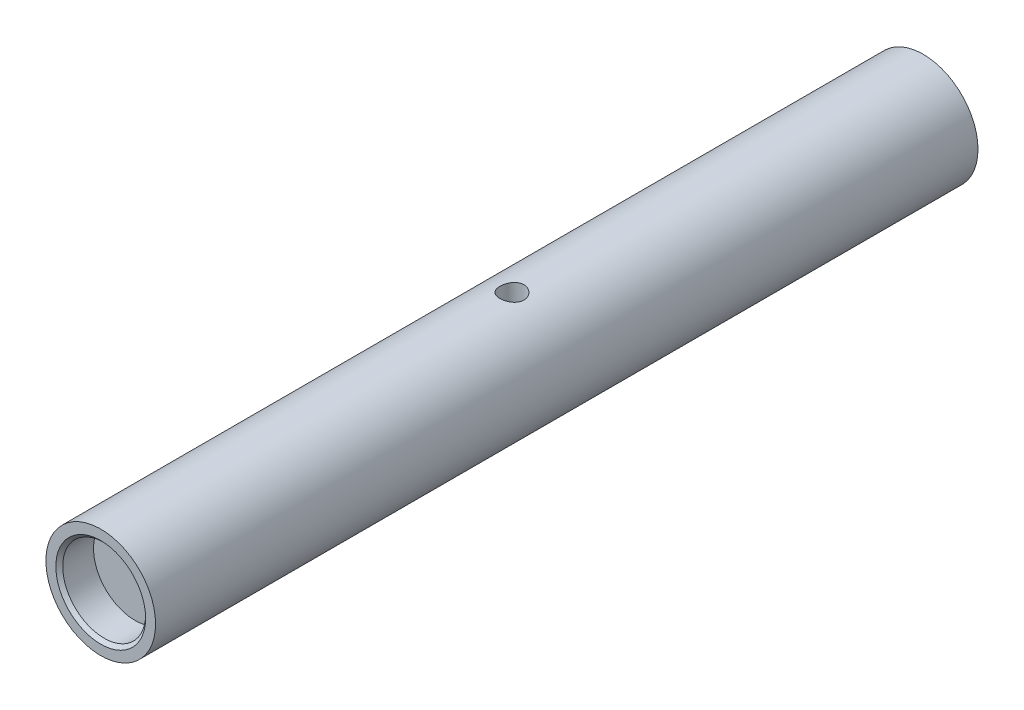
ISO-10303-21;
HEADER;
FILE_DESCRIPTION(('STEP AP214'),'2;1');
FILE_NAME('part.step','',(''),(''),'','','');
FILE_SCHEMA(('AUTOMOTIVE_DESIGN { 1 0 10303 214 1 1 1 1 }'));
ENDSEC;
DATA;
#1=APPLICATION_CONTEXT('core data for automotive mechanical design processes');
#2=APPLICATION_PROTOCOL_DEFINITION('international standard','automotive_design',2000,#1);
#3=PRODUCT_CONTEXT('',#1,'mechanical');
#4=PRODUCT('Part','Part','',(#3));
#5=PRODUCT_RELATED_PRODUCT_CATEGORY('part','',(#4));
#6=PRODUCT_DEFINITION_FORMATION('','',#4);
#7=PRODUCT_DEFINITION_CONTEXT('part definition',#1,'design');
#8=PRODUCT_DEFINITION('design','',#6,#7);
#9=PRODUCT_DEFINITION_SHAPE('','',#8);
#10=(LENGTH_UNIT() NAMED_UNIT(*) SI_UNIT(.MILLI.,.METRE.));
#11=(NAMED_UNIT(*) PLANE_ANGLE_UNIT() SI_UNIT($,.RADIAN.));
#12=(NAMED_UNIT(*) SI_UNIT($,.STERADIAN.) SOLID_ANGLE_UNIT());
#13=UNCERTAINTY_MEASURE_WITH_UNIT(LENGTH_MEASURE(1.E-05),#10,'distance_accuracy_value','');
#14=(GEOMETRIC_REPRESENTATION_CONTEXT(3) GLOBAL_UNCERTAINTY_ASSIGNED_CONTEXT((#13)) GLOBAL_UNIT_ASSIGNED_CONTEXT((#10,
#11,#12)) REPRESENTATION_CONTEXT('',''));
#15=CARTESIAN_POINT('',(0.,0.,0.));
#16=DIRECTION('',(0.,0.,1.));
#17=DIRECTION('',(1.,0.,0.));
#18=AXIS2_PLACEMENT_3D('',#15,#16,#17);
#19=CARTESIAN_POINT('',(0.,0.,0.));
#20=DIRECTION('',(0.,0.,1.));
#21=DIRECTION('',(1.,0.,0.));
#22=AXIS2_PLACEMENT_3D('',#19,#20,#21);
#23=PLANE('',#22);
#24=CARTESIAN_POINT('',(0.,0.,0.));
#25=DIRECTION('',(0.,0.,1.));
#26=DIRECTION('',(1.,0.,0.));
#27=AXIS2_PLACEMENT_3D('',#24,#25,#26);
#28=CIRCLE('',#27,3.275);
#29=CARTESIAN_POINT('',(3.275,0.,0.));
#30=VERTEX_POINT('',#29);
#31=EDGE_CURVE('E126',#30,#30,#28,.T.);
#32=ORIENTED_EDGE('',*,*,#31,.T.);
#33=EDGE_LOOP('',(#32));
#34=FACE_BOUND('',#33,.T.);
#35=CARTESIAN_POINT('',(0.,0.,0.));
#36=DIRECTION('',(0.,0.,1.));
#37=DIRECTION('',(1.,0.,0.));
#38=AXIS2_PLACEMENT_3D('',#35,#36,#37);
#39=CIRCLE('',#38,4.);
#40=CARTESIAN_POINT('',(4.,0.,0.));
#41=VERTEX_POINT('',#40);
#42=EDGE_CURVE('E129',#41,#41,#39,.T.);
#43=ORIENTED_EDGE('',*,*,#42,.F.);
#44=EDGE_LOOP('',(#43));
#45=FACE_BOUND('',#44,.T.);
#46=ADVANCED_FACE('F58',(#34,#45),#23,.F.);
#47=CARTESIAN_POINT('',(0.,0.,60.));
#48=DIRECTION('',(0.,0.,-1.));
#49=DIRECTION('',(-1.,0.,0.));
#50=AXIS2_PLACEMENT_3D('',#47,#48,#49);
#51=CYLINDRICAL_SURFACE('',#50,4.);
#52=CARTESIAN_POINT('',(0.,-4.,30.875));
#53=CARTESIAN_POINT('',(0.0485296675075799,-3.999999104881,30.8749983428683));
#54=CARTESIAN_POINT('',(0.0970793594678819,-3.99910785249099,30.8709490066694));
#55=CARTESIAN_POINT('',(0.192799696712597,-3.99563855625355,30.8548754736168));
#56=CARTESIAN_POINT('',(0.239969331544124,-3.99305930725422,30.8428455789276));
#57=CARTESIAN_POINT('',(0.331532361404727,-3.9865011953795,30.8112057558575));
#58=CARTESIAN_POINT('',(0.375928600591133,-3.98252379502992,30.79160374612));
#59=CARTESIAN_POINT('',(0.460800529275785,-3.97359865018097,30.7454012516593));
#60=CARTESIAN_POINT('',(0.501276320062931,-3.96865093076081,30.7188009478104));
#61=CARTESIAN_POINT('',(0.577809589511013,-3.95823836852585,30.6589051446875));
#62=CARTESIAN_POINT('',(0.613795138857461,-3.95276711096147,30.6255188432995));
#63=CARTESIAN_POINT('',(0.679702737263149,-3.94196931566843,30.5531936935482));
#64=CARTESIAN_POINT('',(0.709624245588626,-3.93664279088231,30.5142543505442));
#65=CARTESIAN_POINT('',(0.762871774375957,-3.92667429652769,30.4313966172081));
#66=CARTESIAN_POINT('',(0.786121217885695,-3.92204054646568,30.3874279384103));
#67=CARTESIAN_POINT('',(0.824873444918545,-3.91407431994669,30.2960895789943));
#68=CARTESIAN_POINT('',(0.840377154907059,-3.91074168787371,30.248720305896));
#69=CARTESIAN_POINT('',(0.862960098833079,-3.9058203563413,30.1527056524806));
#70=CARTESIAN_POINT('',(0.87016668480818,-3.90420532386006,30.1040916043573));
#71=CARTESIAN_POINT('',(0.876346796298366,-3.90282296286985,30.0063197196052));
#72=CARTESIAN_POINT('',(0.875321334008504,-3.90305540719905,29.9571619505735));
#73=CARTESIAN_POINT('',(0.865168943291378,-3.90531789681697,29.8606448324483));
#74=CARTESIAN_POINT('',(0.856189962165253,-3.90731511305879,29.8132690349711));
#75=CARTESIAN_POINT('',(0.830619808880288,-3.91283020532071,29.7207129435417));
#76=CARTESIAN_POINT('',(0.814028209565158,-3.91634816667162,29.675532772947));
#77=CARTESIAN_POINT('',(0.773567951295842,-3.92454071287622,29.5882345328551));
#78=CARTESIAN_POINT('',(0.749642406312967,-3.92922428341758,29.5461437067894));
#79=CARTESIAN_POINT('',(0.695233414544362,-3.93921481609642,29.4665195408901));
#80=CARTESIAN_POINT('',(0.664749073651175,-3.94452186318257,29.428986823519));
#81=CARTESIAN_POINT('',(0.59730468744541,-3.95530223130413,29.3586925198039));
#82=CARTESIAN_POINT('',(0.560218839255175,-3.96077666595924,29.3260516876332));
#83=CARTESIAN_POINT('',(0.48103761810218,-3.9711704462268,29.2674331187011));
#84=CARTESIAN_POINT('',(0.43894215437921,-3.97608978177926,29.2414555026855));
#85=CARTESIAN_POINT('',(0.35078922440041,-3.9848350607036,29.1968709211838));
#86=CARTESIAN_POINT('',(0.304723505551048,-3.98865865150265,29.1782797819633));
#87=CARTESIAN_POINT('',(0.210019715620069,-3.9947641368429,29.1491355665162));
#88=CARTESIAN_POINT('',(0.161382019783212,-3.99704625561537,29.1385813211691));
#89=CARTESIAN_POINT('',(0.0639507148145898,-3.99977974679768,29.1259861330918));
#90=CARTESIAN_POINT('',(0.0151793961812069,-4.00026658638469,29.1237802386593));
#91=CARTESIAN_POINT('',(-0.082034870466852,-3.99945405533806,29.1274972717505));
#92=CARTESIAN_POINT('',(-0.130477840534428,-3.99815480588256,29.1334196478074));
#93=CARTESIAN_POINT('',(-0.225113737082573,-3.99393846563228,29.1530883324419));
#94=CARTESIAN_POINT('',(-0.271325513716627,-3.99103927453648,29.1667481209045));
#95=CARTESIAN_POINT('',(-0.360801880163476,-3.98394755671356,29.2014078430434));
#96=CARTESIAN_POINT('',(-0.404066218480078,-3.97975491978885,29.2224084021511));
#97=CARTESIAN_POINT('',(-0.48710164185679,-3.97045389831677,29.2714972068292));
#98=CARTESIAN_POINT('',(-0.526814043017134,-3.96533329557813,29.2996823517689));
#99=CARTESIAN_POINT('',(-0.601004660955358,-3.9547692903853,29.3622126556686));
#100=CARTESIAN_POINT('',(-0.635482196713101,-3.9493258460595,29.3965586148427));
#101=CARTESIAN_POINT('',(-0.698876552531175,-3.93860716335125,29.4711925116543));
#102=CARTESIAN_POINT('',(-0.72767915190767,-3.93333687534893,29.5115783115546));
#103=CARTESIAN_POINT('',(-0.778093630573717,-3.92367580945748,29.596710789346));
#104=CARTESIAN_POINT('',(-0.799705820995297,-3.9192849935165,29.64145727844));
#105=CARTESIAN_POINT('',(-0.834980047203339,-3.91192194395948,29.7338010176641));
#106=CARTESIAN_POINT('',(-0.848686781972237,-3.90894175193223,29.7813805274312));
#107=CARTESIAN_POINT('',(-0.867891936661354,-3.90472304192499,29.8782410023201));
#108=CARTESIAN_POINT('',(-0.873391669486653,-3.90348424536925,29.9275216940066));
#109=CARTESIAN_POINT('',(-0.875970818550232,-3.90290614373566,30.0252339623401));
#110=CARTESIAN_POINT('',(-0.873231339561962,-3.90352598337475,30.0736606048087));
#111=CARTESIAN_POINT('',(-0.859814710209802,-3.9065029151626,30.1693443115484));
#112=CARTESIAN_POINT('',(-0.84913765342234,-3.90885998683107,30.2166013896009));
#113=CARTESIAN_POINT('',(-0.820236455341648,-3.9150258828629,30.3084606158192));
#114=CARTESIAN_POINT('',(-0.802038675909168,-3.91882963261068,30.3530714212863));
#115=CARTESIAN_POINT('',(-0.758635244842823,-3.92746228874877,30.4386336457775));
#116=CARTESIAN_POINT('',(-0.733428862929913,-3.93229130195659,30.4795846828748));
#117=CARTESIAN_POINT('',(-0.676123075430405,-3.94255241571366,30.5575576742069));
#118=CARTESIAN_POINT('',(-0.643894606521509,-3.9479947357973,30.5944834472532));
#119=CARTESIAN_POINT('',(-0.573721027564935,-3.95880058003569,30.6624621234631));
#120=CARTESIAN_POINT('',(-0.535774597741608,-3.96416408568461,30.6935136670407));
#121=CARTESIAN_POINT('',(-0.454648895620082,-3.9742905205065,30.7492481674261));
#122=CARTESIAN_POINT('',(-0.411408110818716,-3.97904475343567,30.7738432563747));
#123=CARTESIAN_POINT('',(-0.321311391687112,-3.98732971331219,30.8153773501883));
#124=CARTESIAN_POINT('',(-0.274458527502611,-3.99086146560895,30.8323227748171));
#125=CARTESIAN_POINT('',(-0.189632590983234,-3.99567349409931,30.8550570181195));
#126=CARTESIAN_POINT('',(-0.152118353961793,-3.99728588308234,30.8625213644528));
#127=CARTESIAN_POINT('',(-0.0764068622026353,-3.99944946489668,30.8724933979023));
#128=CARTESIAN_POINT('',(-0.0382096378172668,-4.00000070476834,30.875001304736));
#129=CARTESIAN_POINT('',(0.,-4.,30.875));
#130=B_SPLINE_CURVE_WITH_KNOTS('',3,(#52,#53,#54,#55,#56,#57,#58,#59,#60,#61,#62,#63,#64,#65,
#66,#67,#68,#69,#70,#71,#72,#73,#74,#75,#76,#77,#78,#79,#80,#81,#82,#83,#84,#85,#86,#87,#88,#89,
#90,#91,#92,#93,#94,#95,#96,#97,#98,#99,#100,#101,#102,#103,#104,#105,#106,#107,#108,#109,#110,
#111,#112,#113,#114,#115,#116,#117,#118,#119,#120,#121,#122,#123,#124,#125,#126,#127,#128,#129),
.UNSPECIFIED.,.T.,.F.,(4,2,2,2,2,2,2,2,2,2,2,2,2,2,2,2,2,2,2,2,2,2,2,2,2,2,2,2,2,2,2,2,2,2,2,2,
2,2,4),(0.,0.145449139618424,0.291002236681008,0.436403529872208,0.581801065465752,
0.729290048532886,0.8767921774901,1.0259250854862,1.17504015145645,1.32183459554247,
1.46861099037401,1.61271315234745,1.75682340111473,1.90208101208638,2.04735843741085,
2.1957780923179,2.34420043658305,2.49293909744555,2.64165611727659,2.7874188763872,
2.93317174663699,3.07732609507988,3.22149272842078,3.36771738594078,3.51396105001829,
3.66290053893195,3.8118335823327,3.95991605864055,4.10797484309518,4.2528031304553,
4.39762971045592,4.54195288868223,4.68629111066586,4.83354765423419,4.98083823863261,
5.13004008053341,5.27911647517731,5.39364034505443,5.50815913801308),.UNSPECIFIED.);
#131=CARTESIAN_POINT('',(0.,-4.,30.875));
#132=VERTEX_POINT('',#131);
#133=EDGE_CURVE('E11',#132,#132,#130,.T.);
#134=ORIENTED_EDGE('',*,*,#133,.T.);
#135=EDGE_LOOP('',(#134));
#136=FACE_BOUND('',#135,.T.);
#137=CARTESIAN_POINT('',(0.,4.,30.875));
#138=CARTESIAN_POINT('',(-0.0485296675075799,3.999999104881,30.8749983428683));
#139=CARTESIAN_POINT('',(-0.0970793594678819,3.99910785249099,30.8709490066694));
#140=CARTESIAN_POINT('',(-0.192799696712597,3.99563855625355,30.8548754736168));
#141=CARTESIAN_POINT('',(-0.239969331544124,3.99305930725422,30.8428455789276));
#142=CARTESIAN_POINT('',(-0.331532361404727,3.9865011953795,30.8112057558575));
#143=CARTESIAN_POINT('',(-0.375928600591133,3.98252379502992,30.79160374612));
#144=CARTESIAN_POINT('',(-0.460800529275785,3.97359865018097,30.7454012516593));
#145=CARTESIAN_POINT('',(-0.501276320062931,3.96865093076081,30.7188009478104));
#146=CARTESIAN_POINT('',(-0.577809589511013,3.95823836852585,30.6589051446875));
#147=CARTESIAN_POINT('',(-0.613795138857461,3.95276711096147,30.6255188432995));
#148=CARTESIAN_POINT('',(-0.679702737263149,3.94196931566843,30.5531936935482));
#149=CARTESIAN_POINT('',(-0.709624245588626,3.93664279088231,30.5142543505442));
#150=CARTESIAN_POINT('',(-0.762871774375957,3.92667429652769,30.4313966172081));
#151=CARTESIAN_POINT('',(-0.786121217885695,3.92204054646568,30.3874279384103));
#152=CARTESIAN_POINT('',(-0.824873444918545,3.91407431994669,30.2960895789943));
#153=CARTESIAN_POINT('',(-0.840377154907059,3.91074168787371,30.248720305896));
#154=CARTESIAN_POINT('',(-0.862960098833079,3.9058203563413,30.1527056524806));
#155=CARTESIAN_POINT('',(-0.87016668480818,3.90420532386006,30.1040916043573));
#156=CARTESIAN_POINT('',(-0.876346796298366,3.90282296286985,30.0063197196052));
#157=CARTESIAN_POINT('',(-0.875321334008504,3.90305540719905,29.9571619505735));
#158=CARTESIAN_POINT('',(-0.865168943291378,3.90531789681697,29.8606448324483));
#159=CARTESIAN_POINT('',(-0.856189962165253,3.90731511305879,29.8132690349711));
#160=CARTESIAN_POINT('',(-0.830619808880288,3.91283020532071,29.7207129435417));
#161=CARTESIAN_POINT('',(-0.814028209565158,3.91634816667162,29.675532772947));
#162=CARTESIAN_POINT('',(-0.773567951295842,3.92454071287622,29.5882345328551));
#163=CARTESIAN_POINT('',(-0.749642406312967,3.92922428341758,29.5461437067894));
#164=CARTESIAN_POINT('',(-0.695233414544362,3.93921481609642,29.4665195408901));
#165=CARTESIAN_POINT('',(-0.664749073651175,3.94452186318257,29.428986823519));
#166=CARTESIAN_POINT('',(-0.59730468744541,3.95530223130413,29.3586925198039));
#167=CARTESIAN_POINT('',(-0.560218839255175,3.96077666595924,29.3260516876332));
#168=CARTESIAN_POINT('',(-0.48103761810218,3.9711704462268,29.2674331187011));
#169=CARTESIAN_POINT('',(-0.43894215437921,3.97608978177926,29.2414555026855));
#170=CARTESIAN_POINT('',(-0.35078922440041,3.9848350607036,29.1968709211838));
#171=CARTESIAN_POINT('',(-0.304723505551048,3.98865865150265,29.1782797819633));
#172=CARTESIAN_POINT('',(-0.210019715620069,3.9947641368429,29.1491355665162));
#173=CARTESIAN_POINT('',(-0.161382019783212,3.99704625561537,29.1385813211691));
#174=CARTESIAN_POINT('',(-0.0639507148145898,3.99977974679768,29.1259861330918));
#175=CARTESIAN_POINT('',(-0.0151793961812069,4.00026658638469,29.1237802386593));
#176=CARTESIAN_POINT('',(0.082034870466852,3.99945405533806,29.1274972717505));
#177=CARTESIAN_POINT('',(0.130477840534428,3.99815480588256,29.1334196478074));
#178=CARTESIAN_POINT('',(0.225113737082573,3.99393846563228,29.1530883324419));
#179=CARTESIAN_POINT('',(0.271325513716627,3.99103927453648,29.1667481209045));
#180=CARTESIAN_POINT('',(0.360801880163476,3.98394755671356,29.2014078430434));
#181=CARTESIAN_POINT('',(0.404066218480078,3.97975491978885,29.2224084021511));
#182=CARTESIAN_POINT('',(0.48710164185679,3.97045389831677,29.2714972068292));
#183=CARTESIAN_POINT('',(0.526814043017134,3.96533329557813,29.2996823517689));
#184=CARTESIAN_POINT('',(0.601004660955358,3.9547692903853,29.3622126556686));
#185=CARTESIAN_POINT('',(0.635482196713101,3.9493258460595,29.3965586148427));
#186=CARTESIAN_POINT('',(0.698876552531175,3.93860716335125,29.4711925116543));
#187=CARTESIAN_POINT('',(0.72767915190767,3.93333687534893,29.5115783115546));
#188=CARTESIAN_POINT('',(0.778093630573717,3.92367580945748,29.596710789346));
#189=CARTESIAN_POINT('',(0.799705820995297,3.9192849935165,29.64145727844));
#190=CARTESIAN_POINT('',(0.834980047203339,3.91192194395948,29.7338010176641));
#191=CARTESIAN_POINT('',(0.848686781972237,3.90894175193223,29.7813805274312));
#192=CARTESIAN_POINT('',(0.867891936661354,3.90472304192499,29.8782410023201));
#193=CARTESIAN_POINT('',(0.873391669486653,3.90348424536925,29.9275216940066));
#194=CARTESIAN_POINT('',(0.875970818550232,3.90290614373566,30.0252339623401));
#195=CARTESIAN_POINT('',(0.873231339561962,3.90352598337475,30.0736606048087));
#196=CARTESIAN_POINT('',(0.859814710209802,3.9065029151626,30.1693443115484));
#197=CARTESIAN_POINT('',(0.84913765342234,3.90885998683107,30.2166013896009));
#198=CARTESIAN_POINT('',(0.820236455341648,3.9150258828629,30.3084606158192));
#199=CARTESIAN_POINT('',(0.802038675909168,3.91882963261068,30.3530714212863));
#200=CARTESIAN_POINT('',(0.758635244842823,3.92746228874877,30.4386336457775));
#201=CARTESIAN_POINT('',(0.733428862929913,3.93229130195659,30.4795846828748));
#202=CARTESIAN_POINT('',(0.676123075430405,3.94255241571366,30.5575576742069));
#203=CARTESIAN_POINT('',(0.643894606521509,3.9479947357973,30.5944834472532));
#204=CARTESIAN_POINT('',(0.573721027564935,3.95880058003569,30.6624621234631));
#205=CARTESIAN_POINT('',(0.535774597741608,3.96416408568461,30.6935136670407));
#206=CARTESIAN_POINT('',(0.454648895620082,3.9742905205065,30.7492481674261));
#207=CARTESIAN_POINT('',(0.411408110818716,3.97904475343567,30.7738432563747));
#208=CARTESIAN_POINT('',(0.321311391687112,3.98732971331219,30.8153773501883));
#209=CARTESIAN_POINT('',(0.274458527502611,3.99086146560895,30.8323227748171));
#210=CARTESIAN_POINT('',(0.189632590983234,3.99567349409931,30.8550570181195));
#211=CARTESIAN_POINT('',(0.152118353961793,3.99728588308234,30.8625213644528));
#212=CARTESIAN_POINT('',(0.0764068622026353,3.99944946489668,30.8724933979023));
#213=CARTESIAN_POINT('',(0.0382096378172668,4.00000070476834,30.875001304736));
#214=CARTESIAN_POINT('',(0.,4.,30.875));
#215=B_SPLINE_CURVE_WITH_KNOTS('',3,(#137,#138,#139,#140,#141,#142,#143,#144,#145,#146,#147,
#148,#149,#150,#151,#152,#153,#154,#155,#156,#157,#158,#159,#160,#161,#162,#163,#164,#165,#166,
#167,#168,#169,#170,#171,#172,#173,#174,#175,#176,#177,#178,#179,#180,#181,#182,#183,#184,#185,
#186,#187,#188,#189,#190,#191,#192,#193,#194,#195,#196,#197,#198,#199,#200,#201,#202,#203,#204,
#205,#206,#207,#208,#209,#210,#211,#212,#213,#214),.UNSPECIFIED.,.T.,.F.,(4,2,2,2,2,2,2,2,2,2,2,
2,2,2,2,2,2,2,2,2,2,2,2,2,2,2,2,2,2,2,2,2,2,2,2,2,2,2,4),(0.,0.145449139618424,
0.291002236681008,0.436403529872208,0.581801065465752,0.729290048532886,0.8767921774901,
1.0259250854862,1.17504015145645,1.32183459554247,1.46861099037401,1.61271315234745,
1.75682340111473,1.90208101208638,2.04735843741085,2.1957780923179,2.34420043658305,
2.49293909744555,2.64165611727659,2.7874188763872,2.93317174663699,3.07732609507988,
3.22149272842078,3.36771738594078,3.51396105001829,3.66290053893195,3.8118335823327,
3.95991605864055,4.10797484309518,4.2528031304553,4.39762971045592,4.54195288868223,
4.68629111066586,4.83354765423419,4.98083823863261,5.13004008053341,5.27911647517731,
5.39364034505443,5.50815913801308),.UNSPECIFIED.);
#216=CARTESIAN_POINT('',(0.,4.,30.875));
#217=VERTEX_POINT('',#216);
#218=EDGE_CURVE('E72',#217,#217,#215,.T.);
#219=ORIENTED_EDGE('',*,*,#218,.T.);
#220=EDGE_LOOP('',(#219));
#221=FACE_BOUND('',#220,.T.);
#222=CARTESIAN_POINT('',(0.,0.,60.));
#223=DIRECTION('',(0.,0.,1.));
#224=DIRECTION('',(1.,0.,0.));
#225=AXIS2_PLACEMENT_3D('',#222,#223,#224);
#226=CIRCLE('',#225,4.);
#227=CARTESIAN_POINT('',(4.,0.,60.));
#228=VERTEX_POINT('',#227);
#229=EDGE_CURVE('E132',#228,#228,#226,.T.);
#230=ORIENTED_EDGE('',*,*,#229,.F.);
#231=EDGE_LOOP('',(#230));
#232=FACE_BOUND('',#231,.T.);
#233=ORIENTED_EDGE('',*,*,#42,.T.);
#234=EDGE_LOOP('',(#233));
#235=FACE_BOUND('',#234,.T.);
#236=ADVANCED_FACE('F88',(#136,#221,#232,#235),#51,.T.);
#237=CARTESIAN_POINT('',(0.,0.,60.));
#238=DIRECTION('',(0.,0.,1.));
#239=DIRECTION('',(1.,0.,0.));
#240=AXIS2_PLACEMENT_3D('',#237,#238,#239);
#241=PLANE('',#240);
#242=CARTESIAN_POINT('',(0.,0.,60.));
#243=DIRECTION('',(0.,0.,1.));
#244=DIRECTION('',(1.,0.,0.));
#245=AXIS2_PLACEMENT_3D('',#242,#243,#244);
#246=CIRCLE('',#245,3.275);
#247=CARTESIAN_POINT('',(3.275,0.,60.));
#248=VERTEX_POINT('',#247);
#249=EDGE_CURVE('E77',#248,#248,#246,.F.);
#250=ORIENTED_EDGE('',*,*,#249,.T.);
#251=EDGE_LOOP('',(#250));
#252=FACE_BOUND('',#251,.T.);
#253=ORIENTED_EDGE('',*,*,#229,.T.);
#254=EDGE_LOOP('',(#253));
#255=FACE_BOUND('',#254,.T.);
#256=ADVANCED_FACE('F113',(#252,#255),#241,.T.);
#257=CARTESIAN_POINT('',(0.,0.,2.5));
#258=DIRECTION('',(0.,0.,-1.));
#259=DIRECTION('',(-1.,0.,0.));
#260=AXIS2_PLACEMENT_3D('',#257,#258,#259);
#261=CYLINDRICAL_SURFACE('',#260,3.025);
#262=CARTESIAN_POINT('',(0.,0.,0.249999999999997));
#263=DIRECTION('',(0.,0.,1.));
#264=DIRECTION('',(1.,0.,0.));
#265=AXIS2_PLACEMENT_3D('',#262,#263,#264);
#266=CIRCLE('',#265,3.025);
#267=CARTESIAN_POINT('',(3.025,0.,0.249999999999997));
#268=VERTEX_POINT('',#267);
#269=EDGE_CURVE('E145',#268,#268,#266,.F.);
#270=ORIENTED_EDGE('',*,*,#269,.T.);
#271=EDGE_LOOP('',(#270));
#272=FACE_BOUND('',#271,.T.);
#273=CARTESIAN_POINT('',(0.,0.,2.5));
#274=DIRECTION('',(0.,0.,1.));
#275=DIRECTION('',(1.,0.,0.));
#276=AXIS2_PLACEMENT_3D('',#273,#274,#275);
#277=CIRCLE('',#276,3.025);
#278=CARTESIAN_POINT('',(3.025,0.,2.5));
#279=VERTEX_POINT('',#278);
#280=EDGE_CURVE('E133',#279,#279,#277,.T.);
#281=ORIENTED_EDGE('',*,*,#280,.T.);
#282=EDGE_LOOP('',(#281));
#283=FACE_BOUND('',#282,.T.);
#284=ADVANCED_FACE('F109',(#272,#283),#261,.F.);
#285=CARTESIAN_POINT('',(0.,0.,2.5));
#286=DIRECTION('',(0.,0.,1.));
#287=DIRECTION('',(1.,0.,0.));
#288=AXIS2_PLACEMENT_3D('',#285,#286,#287);
#289=PLANE('',#288);
#290=ORIENTED_EDGE('',*,*,#280,.F.);
#291=EDGE_LOOP('',(#290));
#292=FACE_BOUND('',#291,.T.);
#293=ADVANCED_FACE('F105',(#292),#289,.F.);
#294=CARTESIAN_POINT('',(0.,0.,57.5));
#295=DIRECTION('',(0.,0.,1.));
#296=DIRECTION('',(1.,0.,0.));
#297=AXIS2_PLACEMENT_3D('',#294,#295,#296);
#298=CYLINDRICAL_SURFACE('',#297,3.025);
#299=CARTESIAN_POINT('',(0.,0.,59.75));
#300=DIRECTION('',(0.,0.,1.));
#301=DIRECTION('',(1.,0.,0.));
#302=AXIS2_PLACEMENT_3D('',#299,#300,#301);
#303=CIRCLE('',#302,3.025);
#304=CARTESIAN_POINT('',(3.025,0.,59.75));
#305=VERTEX_POINT('',#304);
#306=EDGE_CURVE('E82',#305,#305,#303,.T.);
#307=ORIENTED_EDGE('',*,*,#306,.T.);
#308=EDGE_LOOP('',(#307));
#309=FACE_BOUND('',#308,.T.);
#310=CARTESIAN_POINT('',(0.,0.,57.5));
#311=DIRECTION('',(0.,0.,1.));
#312=DIRECTION('',(1.,0.,0.));
#313=AXIS2_PLACEMENT_3D('',#310,#311,#312);
#314=CIRCLE('',#313,3.025);
#315=CARTESIAN_POINT('',(3.025,0.,57.5));
#316=VERTEX_POINT('',#315);
#317=EDGE_CURVE('E140',#316,#316,#314,.T.);
#318=ORIENTED_EDGE('',*,*,#317,.F.);
#319=EDGE_LOOP('',(#318));
#320=FACE_BOUND('',#319,.T.);
#321=ADVANCED_FACE('F101',(#309,#320),#298,.F.);
#322=CARTESIAN_POINT('',(0.,0.,57.5));
#323=DIRECTION('',(0.,0.,1.));
#324=DIRECTION('',(1.,0.,0.));
#325=AXIS2_PLACEMENT_3D('',#322,#323,#324);
#326=PLANE('',#325);
#327=ORIENTED_EDGE('',*,*,#317,.T.);
#328=EDGE_LOOP('',(#327));
#329=FACE_BOUND('',#328,.T.);
#330=ADVANCED_FACE('F96',(#329),#326,.T.);
#331=CARTESIAN_POINT('',(0.,0.,0.));
#332=DIRECTION('',(0.,0.,-1.));
#333=DIRECTION('',(-1.,0.,0.));
#334=AXIS2_PLACEMENT_3D('',#331,#332,#333);
#335=CONICAL_SURFACE('',#334,3.275,0.785398163397455);
#336=ORIENTED_EDGE('',*,*,#269,.F.);
#337=EDGE_LOOP('',(#336));
#338=FACE_BOUND('',#337,.T.);
#339=ORIENTED_EDGE('',*,*,#31,.F.);
#340=EDGE_LOOP('',(#339));
#341=FACE_BOUND('',#340,.T.);
#342=ADVANCED_FACE('F100',(#338,#341),#335,.F.);
#343=CARTESIAN_POINT('',(0.,0.,59.75));
#344=DIRECTION('',(0.,0.,1.));
#345=DIRECTION('',(1.,0.,0.));
#346=AXIS2_PLACEMENT_3D('',#343,#344,#345);
#347=CONICAL_SURFACE('',#346,3.025,0.785398163397448);
#348=ORIENTED_EDGE('',*,*,#249,.F.);
#349=EDGE_LOOP('',(#348));
#350=FACE_BOUND('',#349,.T.);
#351=ORIENTED_EDGE('',*,*,#306,.F.);
#352=EDGE_LOOP('',(#351));
#353=FACE_BOUND('',#352,.T.);
#354=ADVANCED_FACE('F61',(#350,#353),#347,.F.);
#355=CARTESIAN_POINT('',(0.,-4.,30.));
#356=DIRECTION('',(0.,1.,0.));
#357=DIRECTION('',(0.,0.,1.));
#358=AXIS2_PLACEMENT_3D('',#355,#356,#357);
#359=CYLINDRICAL_SURFACE('',#358,0.875);
#360=ORIENTED_EDGE('',*,*,#218,.F.);
#361=EDGE_LOOP('',(#360));
#362=FACE_BOUND('',#361,.T.);
#363=ORIENTED_EDGE('',*,*,#133,.F.);
#364=EDGE_LOOP('',(#363));
#365=FACE_BOUND('',#364,.T.);
#366=ADVANCED_FACE('F91',(#362,#365),#359,.F.);
#367=CLOSED_SHELL('',(#46,#236,#256,#284,#293,#321,#330,#342,#354,#366));
#368=MANIFOLD_SOLID_BREP('B2',#367);
#369=ADVANCED_BREP_SHAPE_REPRESENTATION('',(#18,#368),#14);
#370=SHAPE_DEFINITION_REPRESENTATION(#9,#369);
ENDSEC;
END-ISO-10303-21;
